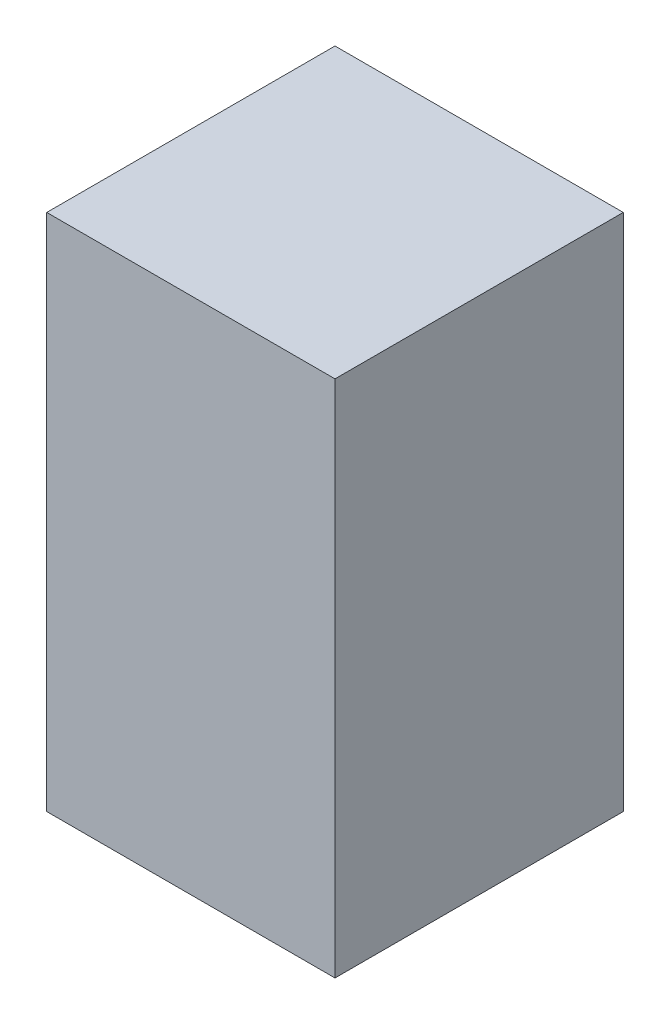
ISO-10303-21;
HEADER;
FILE_DESCRIPTION(('STEP AP214'),'2;1');
FILE_NAME('part.step','',(''),(''),'','','');
FILE_SCHEMA(('AUTOMOTIVE_DESIGN { 1 0 10303 214 1 1 1 1 }'));
ENDSEC;
DATA;
#1=APPLICATION_CONTEXT('core data for automotive mechanical design processes');
#2=APPLICATION_PROTOCOL_DEFINITION('international standard','automotive_design',2000,#1);
#3=PRODUCT_CONTEXT('',#1,'mechanical');
#4=PRODUCT('Part','Part','',(#3));
#5=PRODUCT_RELATED_PRODUCT_CATEGORY('part','',(#4));
#6=PRODUCT_DEFINITION_FORMATION('','',#4);
#7=PRODUCT_DEFINITION_CONTEXT('part definition',#1,'design');
#8=PRODUCT_DEFINITION('design','',#6,#7);
#9=PRODUCT_DEFINITION_SHAPE('','',#8);
#10=(LENGTH_UNIT() NAMED_UNIT(*) SI_UNIT(.MILLI.,.METRE.));
#11=(NAMED_UNIT(*) PLANE_ANGLE_UNIT() SI_UNIT($,.RADIAN.));
#12=(NAMED_UNIT(*) SI_UNIT($,.STERADIAN.) SOLID_ANGLE_UNIT());
#13=UNCERTAINTY_MEASURE_WITH_UNIT(LENGTH_MEASURE(1.E-05),#10,'distance_accuracy_value','');
#14=(GEOMETRIC_REPRESENTATION_CONTEXT(3) GLOBAL_UNCERTAINTY_ASSIGNED_CONTEXT((#13)) GLOBAL_UNIT_ASSIGNED_CONTEXT((#10,
#11,#12)) REPRESENTATION_CONTEXT('',''));
#15=CARTESIAN_POINT('',(0.,0.,0.));
#16=DIRECTION('',(0.,0.,1.));
#17=DIRECTION('',(1.,0.,0.));
#18=AXIS2_PLACEMENT_3D('',#15,#16,#17);
#19=CARTESIAN_POINT('',(0.2499995,-0.44999656,0.));
#20=DIRECTION('',(-1.,0.,0.));
#21=DIRECTION('',(0.,0.,1.));
#22=AXIS2_PLACEMENT_3D('',#19,#20,#21);
#23=PLANE('',#22);
#24=DIRECTION('',(0.,0.,-1.));
#25=VECTOR('',#24,1.);
#26=CARTESIAN_POINT('',(0.2499995,0.4499991,0.));
#27=LINE('',#26,#25);
#28=CARTESIAN_POINT('',(0.2499995,0.4499991,0.));
#29=VERTEX_POINT('',#28);
#30=CARTESIAN_POINT('',(0.2499995,0.4499991,0.499999));
#31=VERTEX_POINT('',#30);
#32=EDGE_CURVE('E20',#29,#31,#27,.F.);
#33=ORIENTED_EDGE('',*,*,#32,.T.);
#34=DIRECTION('',(0.,1.,0.));
#35=VECTOR('',#34,1.);
#36=CARTESIAN_POINT('',(0.2499995,0.4499991,0.499999));
#37=LINE('',#36,#35);
#38=CARTESIAN_POINT('',(0.2499995,-0.44999656,0.499999));
#39=VERTEX_POINT('',#38);
#40=EDGE_CURVE('E55',#31,#39,#37,.F.);
#41=ORIENTED_EDGE('',*,*,#40,.T.);
#42=DIRECTION('',(0.,0.,1.));
#43=VECTOR('',#42,1.);
#44=CARTESIAN_POINT('',(0.2499995,-0.44999656,0.));
#45=LINE('',#44,#43);
#46=CARTESIAN_POINT('',(0.2499995,-0.44999656,0.));
#47=VERTEX_POINT('',#46);
#48=EDGE_CURVE('E76',#39,#47,#45,.F.);
#49=ORIENTED_EDGE('',*,*,#48,.T.);
#50=DIRECTION('',(0.,1.,0.));
#51=VECTOR('',#50,1.);
#52=CARTESIAN_POINT('',(0.2499995,0.4499991,0.));
#53=LINE('',#52,#51);
#54=EDGE_CURVE('E58',#29,#47,#53,.F.);
#55=ORIENTED_EDGE('',*,*,#54,.F.);
#56=EDGE_LOOP('',(#33,#41,#49,#55));
#57=FACE_BOUND('',#56,.T.);
#58=ADVANCED_FACE('F17',(#57),#23,.F.);
#59=CARTESIAN_POINT('',(0.2499995,0.4499991,0.));
#60=DIRECTION('',(0.,-1.,0.));
#61=DIRECTION('',(0.,0.,-1.));
#62=AXIS2_PLACEMENT_3D('',#59,#60,#61);
#63=PLANE('',#62);
#64=DIRECTION('',(0.,0.,-1.));
#65=VECTOR('',#64,1.);
#66=CARTESIAN_POINT('',(-0.2499995,0.4499991,0.));
#67=LINE('',#66,#65);
#68=CARTESIAN_POINT('',(-0.2499995,0.4499991,0.));
#69=VERTEX_POINT('',#68);
#70=CARTESIAN_POINT('',(-0.2499995,0.4499991,0.499999));
#71=VERTEX_POINT('',#70);
#72=EDGE_CURVE('E73',#69,#71,#67,.F.);
#73=ORIENTED_EDGE('',*,*,#72,.T.);
#74=DIRECTION('',(-1.,0.,0.));
#75=VECTOR('',#74,1.);
#76=CARTESIAN_POINT('',(-0.2499995,0.4499991,0.499999));
#77=LINE('',#76,#75);
#78=EDGE_CURVE('E63',#71,#31,#77,.F.);
#79=ORIENTED_EDGE('',*,*,#78,.T.);
#80=ORIENTED_EDGE('',*,*,#32,.F.);
#81=DIRECTION('',(-1.,0.,0.));
#82=VECTOR('',#81,1.);
#83=CARTESIAN_POINT('',(-0.2499995,0.4499991,0.));
#84=LINE('',#83,#82);
#85=EDGE_CURVE('E78',#69,#29,#84,.F.);
#86=ORIENTED_EDGE('',*,*,#85,.F.);
#87=EDGE_LOOP('',(#73,#79,#80,#86));
#88=FACE_BOUND('',#87,.T.);
#89=ADVANCED_FACE('F72',(#88),#63,.F.);
#90=CARTESIAN_POINT('',(-0.2499995,0.4499991,0.499999));
#91=DIRECTION('',(0.,0.,-1.));
#92=DIRECTION('',(-1.,0.,0.));
#93=AXIS2_PLACEMENT_3D('',#90,#91,#92);
#94=PLANE('',#93);
#95=DIRECTION('',(1.,0.,0.));
#96=VECTOR('',#95,1.);
#97=CARTESIAN_POINT('',(-0.2499995,-0.44999656,0.499999));
#98=LINE('',#97,#96);
#99=CARTESIAN_POINT('',(-0.2499995,-0.44999656,0.499999));
#100=VERTEX_POINT('',#99);
#101=EDGE_CURVE('E69',#100,#39,#98,.T.);
#102=ORIENTED_EDGE('',*,*,#101,.T.);
#103=ORIENTED_EDGE('',*,*,#40,.F.);
#104=ORIENTED_EDGE('',*,*,#78,.F.);
#105=DIRECTION('',(0.,1.,0.));
#106=VECTOR('',#105,1.);
#107=CARTESIAN_POINT('',(-0.2499995,0.4499991,0.499999));
#108=LINE('',#107,#106);
#109=EDGE_CURVE('E83',#71,#100,#108,.F.);
#110=ORIENTED_EDGE('',*,*,#109,.T.);
#111=EDGE_LOOP('',(#102,#103,#104,#110));
#112=FACE_BOUND('',#111,.T.);
#113=ADVANCED_FACE('F66',(#112),#94,.F.);
#114=CARTESIAN_POINT('',(-0.2499995,-0.44999656,0.));
#115=DIRECTION('',(0.,1.,0.));
#116=DIRECTION('',(0.,0.,1.));
#117=AXIS2_PLACEMENT_3D('',#114,#115,#116);
#118=PLANE('',#117);
#119=ORIENTED_EDGE('',*,*,#48,.F.);
#120=ORIENTED_EDGE('',*,*,#101,.F.);
#121=DIRECTION('',(0.,0.,-1.));
#122=VECTOR('',#121,1.);
#123=CARTESIAN_POINT('',(-0.2499995,-0.44999656,0.));
#124=LINE('',#123,#122);
#125=CARTESIAN_POINT('',(-0.2499995,-0.44999656,0.));
#126=VERTEX_POINT('',#125);
#127=EDGE_CURVE('E26',#100,#126,#124,.T.);
#128=ORIENTED_EDGE('',*,*,#127,.T.);
#129=DIRECTION('',(-1.,0.,0.));
#130=VECTOR('',#129,1.);
#131=CARTESIAN_POINT('',(-0.2499995,-0.44999656,0.));
#132=LINE('',#131,#130);
#133=EDGE_CURVE('E34',#47,#126,#132,.T.);
#134=ORIENTED_EDGE('',*,*,#133,.F.);
#135=EDGE_LOOP('',(#119,#120,#128,#134));
#136=FACE_BOUND('',#135,.T.);
#137=ADVANCED_FACE('F88',(#136),#118,.F.);
#138=CARTESIAN_POINT('',(-0.2499995,0.4499991,0.));
#139=DIRECTION('',(0.,0.,-1.));
#140=DIRECTION('',(-1.,0.,0.));
#141=AXIS2_PLACEMENT_3D('',#138,#139,#140);
#142=PLANE('',#141);
#143=ORIENTED_EDGE('',*,*,#133,.T.);
#144=DIRECTION('',(0.,1.,0.));
#145=VECTOR('',#144,1.);
#146=CARTESIAN_POINT('',(-0.2499995,0.4499991,0.));
#147=LINE('',#146,#145);
#148=EDGE_CURVE('E11',#126,#69,#147,.T.);
#149=ORIENTED_EDGE('',*,*,#148,.T.);
#150=ORIENTED_EDGE('',*,*,#85,.T.);
#151=ORIENTED_EDGE('',*,*,#54,.T.);
#152=EDGE_LOOP('',(#143,#149,#150,#151));
#153=FACE_BOUND('',#152,.T.);
#154=ADVANCED_FACE('F91',(#153),#142,.T.);
#155=CARTESIAN_POINT('',(-0.2499995,0.4499991,0.));
#156=DIRECTION('',(1.,0.,0.));
#157=DIRECTION('',(0.,0.,-1.));
#158=AXIS2_PLACEMENT_3D('',#155,#156,#157);
#159=PLANE('',#158);
#160=ORIENTED_EDGE('',*,*,#127,.F.);
#161=ORIENTED_EDGE('',*,*,#109,.F.);
#162=ORIENTED_EDGE('',*,*,#72,.F.);
#163=ORIENTED_EDGE('',*,*,#148,.F.);
#164=EDGE_LOOP('',(#160,#161,#162,#163));
#165=FACE_BOUND('',#164,.T.);
#166=ADVANCED_FACE('F90',(#165),#159,.F.);
#167=CLOSED_SHELL('',(#58,#89,#113,#137,#154,#166));
#168=MANIFOLD_SOLID_BREP('B1',#167);
#169=ADVANCED_BREP_SHAPE_REPRESENTATION('',(#18,#168),#14);
#170=SHAPE_DEFINITION_REPRESENTATION(#9,#169);
ENDSEC;
END-ISO-10303-21;
